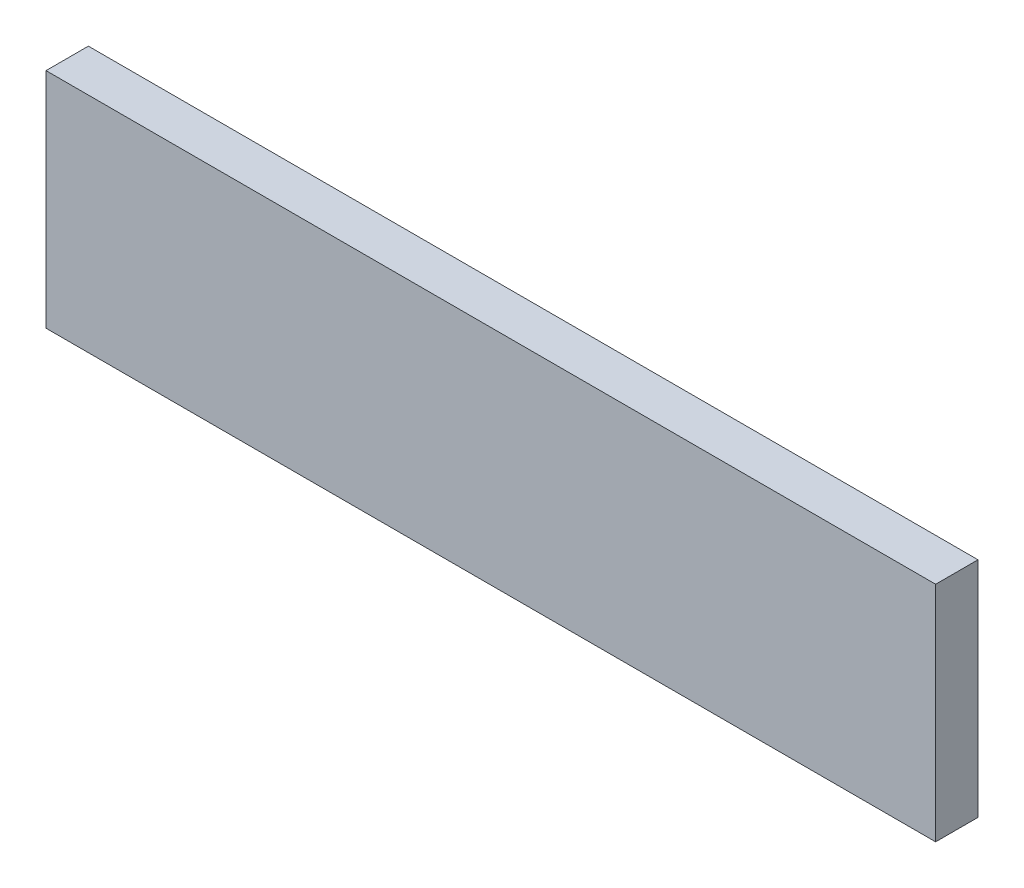
ISO-10303-21;
HEADER;
FILE_DESCRIPTION(('STEP AP214'),'2;1');
FILE_NAME('part.step','',(''),(''),'','','');
FILE_SCHEMA(('AUTOMOTIVE_DESIGN { 1 0 10303 214 1 1 1 1 }'));
ENDSEC;
DATA;
#1=APPLICATION_CONTEXT('core data for automotive mechanical design processes');
#2=APPLICATION_PROTOCOL_DEFINITION('international standard','automotive_design',2000,#1);
#3=PRODUCT_CONTEXT('',#1,'mechanical');
#4=PRODUCT('Part','Part','',(#3));
#5=PRODUCT_RELATED_PRODUCT_CATEGORY('part','',(#4));
#6=PRODUCT_DEFINITION_FORMATION('','',#4);
#7=PRODUCT_DEFINITION_CONTEXT('part definition',#1,'design');
#8=PRODUCT_DEFINITION('design','',#6,#7);
#9=PRODUCT_DEFINITION_SHAPE('','',#8);
#10=(LENGTH_UNIT() NAMED_UNIT(*) SI_UNIT(.MILLI.,.METRE.));
#11=(NAMED_UNIT(*) PLANE_ANGLE_UNIT() SI_UNIT($,.RADIAN.));
#12=(NAMED_UNIT(*) SI_UNIT($,.STERADIAN.) SOLID_ANGLE_UNIT());
#13=UNCERTAINTY_MEASURE_WITH_UNIT(LENGTH_MEASURE(1.E-05),#10,'distance_accuracy_value','');
#14=(GEOMETRIC_REPRESENTATION_CONTEXT(3) GLOBAL_UNCERTAINTY_ASSIGNED_CONTEXT((#13)) GLOBAL_UNIT_ASSIGNED_CONTEXT((#10,
#11,#12)) REPRESENTATION_CONTEXT('',''));
#15=CARTESIAN_POINT('',(0.,0.,0.));
#16=DIRECTION('',(0.,0.,1.));
#17=DIRECTION('',(1.,0.,0.));
#18=AXIS2_PLACEMENT_3D('',#15,#16,#17);
#19=CARTESIAN_POINT('',(40.005,-10.033,3.81));
#20=DIRECTION('',(-1.,0.,0.));
#21=DIRECTION('',(0.,0.,1.));
#22=AXIS2_PLACEMENT_3D('',#19,#20,#21);
#23=PLANE('',#22);
#24=DIRECTION('',(0.,1.,0.));
#25=VECTOR('',#24,1.);
#26=CARTESIAN_POINT('',(40.005,-10.033,0.));
#27=LINE('',#26,#25);
#28=CARTESIAN_POINT('',(40.005,-10.033,0.));
#29=VERTEX_POINT('',#28);
#30=CARTESIAN_POINT('',(40.005,10.033,0.));
#31=VERTEX_POINT('',#30);
#32=EDGE_CURVE('E107',#29,#31,#27,.T.);
#33=ORIENTED_EDGE('',*,*,#32,.T.);
#34=DIRECTION('',(0.,0.,-1.));
#35=VECTOR('',#34,1.);
#36=CARTESIAN_POINT('',(40.005,10.033,3.81));
#37=LINE('',#36,#35);
#38=CARTESIAN_POINT('',(40.005,10.033,3.81));
#39=VERTEX_POINT('',#38);
#40=EDGE_CURVE('E11',#39,#31,#37,.T.);
#41=ORIENTED_EDGE('',*,*,#40,.F.);
#42=DIRECTION('',(0.,1.,0.));
#43=VECTOR('',#42,1.);
#44=CARTESIAN_POINT('',(40.005,-10.033,3.81));
#45=LINE('',#44,#43);
#46=CARTESIAN_POINT('',(40.005,-10.033,3.81));
#47=VERTEX_POINT('',#46);
#48=EDGE_CURVE('E91',#47,#39,#45,.T.);
#49=ORIENTED_EDGE('',*,*,#48,.F.);
#50=DIRECTION('',(0.,0.,-1.));
#51=VECTOR('',#50,1.);
#52=CARTESIAN_POINT('',(40.005,-10.033,3.81));
#53=LINE('',#52,#51);
#54=EDGE_CURVE('E103',#47,#29,#53,.T.);
#55=ORIENTED_EDGE('',*,*,#54,.T.);
#56=EDGE_LOOP('',(#33,#41,#49,#55));
#57=FACE_BOUND('',#56,.T.);
#58=ADVANCED_FACE('F39',(#57),#23,.F.);
#59=CARTESIAN_POINT('',(-40.005,10.033,3.81));
#60=DIRECTION('',(0.,-1.,0.));
#61=DIRECTION('',(0.,0.,-1.));
#62=AXIS2_PLACEMENT_3D('',#59,#60,#61);
#63=PLANE('',#62);
#64=DIRECTION('',(-1.,0.,0.));
#65=VECTOR('',#64,1.);
#66=CARTESIAN_POINT('',(-40.005,10.033,0.));
#67=LINE('',#66,#65);
#68=CARTESIAN_POINT('',(-40.005,10.033,0.));
#69=VERTEX_POINT('',#68);
#70=EDGE_CURVE('E96',#31,#69,#67,.T.);
#71=ORIENTED_EDGE('',*,*,#70,.T.);
#72=DIRECTION('',(0.,0.,-1.));
#73=VECTOR('',#72,1.);
#74=CARTESIAN_POINT('',(-40.005,10.033,3.81));
#75=LINE('',#74,#73);
#76=CARTESIAN_POINT('',(-40.005,10.033,3.81));
#77=VERTEX_POINT('',#76);
#78=EDGE_CURVE('E48',#77,#69,#75,.T.);
#79=ORIENTED_EDGE('',*,*,#78,.F.);
#80=DIRECTION('',(-1.,0.,0.));
#81=VECTOR('',#80,1.);
#82=CARTESIAN_POINT('',(-40.005,10.033,3.81));
#83=LINE('',#82,#81);
#84=EDGE_CURVE('E86',#39,#77,#83,.T.);
#85=ORIENTED_EDGE('',*,*,#84,.F.);
#86=ORIENTED_EDGE('',*,*,#40,.T.);
#87=EDGE_LOOP('',(#71,#79,#85,#86));
#88=FACE_BOUND('',#87,.T.);
#89=ADVANCED_FACE('F95',(#88),#63,.F.);
#90=CARTESIAN_POINT('',(-40.005,-10.033,3.81));
#91=DIRECTION('',(1.,0.,0.));
#92=DIRECTION('',(0.,0.,-1.));
#93=AXIS2_PLACEMENT_3D('',#90,#91,#92);
#94=PLANE('',#93);
#95=DIRECTION('',(0.,-1.,0.));
#96=VECTOR('',#95,1.);
#97=CARTESIAN_POINT('',(-40.005,-10.033,0.));
#98=LINE('',#97,#96);
#99=CARTESIAN_POINT('',(-40.005,-10.033,0.));
#100=VERTEX_POINT('',#99);
#101=EDGE_CURVE('E73',#69,#100,#98,.T.);
#102=ORIENTED_EDGE('',*,*,#101,.T.);
#103=DIRECTION('',(0.,0.,-1.));
#104=VECTOR('',#103,1.);
#105=CARTESIAN_POINT('',(-40.005,-10.033,3.81));
#106=LINE('',#105,#104);
#107=CARTESIAN_POINT('',(-40.005,-10.033,3.81));
#108=VERTEX_POINT('',#107);
#109=EDGE_CURVE('E98',#108,#100,#106,.T.);
#110=ORIENTED_EDGE('',*,*,#109,.F.);
#111=DIRECTION('',(0.,-1.,0.));
#112=VECTOR('',#111,1.);
#113=CARTESIAN_POINT('',(-40.005,-10.033,3.81));
#114=LINE('',#113,#112);
#115=EDGE_CURVE('E89',#77,#108,#114,.T.);
#116=ORIENTED_EDGE('',*,*,#115,.F.);
#117=ORIENTED_EDGE('',*,*,#78,.T.);
#118=EDGE_LOOP('',(#102,#110,#116,#117));
#119=FACE_BOUND('',#118,.T.);
#120=ADVANCED_FACE('F99',(#119),#94,.F.);
#121=CARTESIAN_POINT('',(-40.005,-10.033,3.81));
#122=DIRECTION('',(0.,1.,0.));
#123=DIRECTION('',(0.,0.,1.));
#124=AXIS2_PLACEMENT_3D('',#121,#122,#123);
#125=PLANE('',#124);
#126=DIRECTION('',(1.,0.,0.));
#127=VECTOR('',#126,1.);
#128=CARTESIAN_POINT('',(-40.005,-10.033,0.));
#129=LINE('',#128,#127);
#130=EDGE_CURVE('E79',#100,#29,#129,.T.);
#131=ORIENTED_EDGE('',*,*,#130,.T.);
#132=ORIENTED_EDGE('',*,*,#54,.F.);
#133=DIRECTION('',(1.,0.,0.));
#134=VECTOR('',#133,1.);
#135=CARTESIAN_POINT('',(-40.005,-10.033,3.81));
#136=LINE('',#135,#134);
#137=EDGE_CURVE('E56',#108,#47,#136,.T.);
#138=ORIENTED_EDGE('',*,*,#137,.F.);
#139=ORIENTED_EDGE('',*,*,#109,.T.);
#140=EDGE_LOOP('',(#131,#132,#138,#139));
#141=FACE_BOUND('',#140,.T.);
#142=ADVANCED_FACE('F120',(#141),#125,.F.);
#143=CARTESIAN_POINT('',(0.,0.,3.81));
#144=DIRECTION('',(0.,0.,-1.));
#145=DIRECTION('',(-1.,0.,0.));
#146=AXIS2_PLACEMENT_3D('',#143,#144,#145);
#147=PLANE('',#146);
#148=ORIENTED_EDGE('',*,*,#48,.T.);
#149=ORIENTED_EDGE('',*,*,#84,.T.);
#150=ORIENTED_EDGE('',*,*,#115,.T.);
#151=ORIENTED_EDGE('',*,*,#137,.T.);
#152=EDGE_LOOP('',(#148,#149,#150,#151));
#153=FACE_BOUND('',#152,.T.);
#154=ADVANCED_FACE('F87',(#153),#147,.F.);
#155=CARTESIAN_POINT('',(0.,0.,0.));
#156=DIRECTION('',(0.,0.,-1.));
#157=DIRECTION('',(-1.,0.,0.));
#158=AXIS2_PLACEMENT_3D('',#155,#156,#157);
#159=PLANE('',#158);
#160=ORIENTED_EDGE('',*,*,#32,.F.);
#161=ORIENTED_EDGE('',*,*,#130,.F.);
#162=ORIENTED_EDGE('',*,*,#101,.F.);
#163=ORIENTED_EDGE('',*,*,#70,.F.);
#164=EDGE_LOOP('',(#160,#161,#162,#163));
#165=FACE_BOUND('',#164,.T.);
#166=ADVANCED_FACE('F123',(#165),#159,.T.);
#167=CLOSED_SHELL('',(#58,#89,#120,#142,#154,#166));
#168=MANIFOLD_SOLID_BREP('B2',#167);
#169=ADVANCED_BREP_SHAPE_REPRESENTATION('',(#18,#168),#14);
#170=SHAPE_DEFINITION_REPRESENTATION(#9,#169);
ENDSEC;
END-ISO-10303-21;
